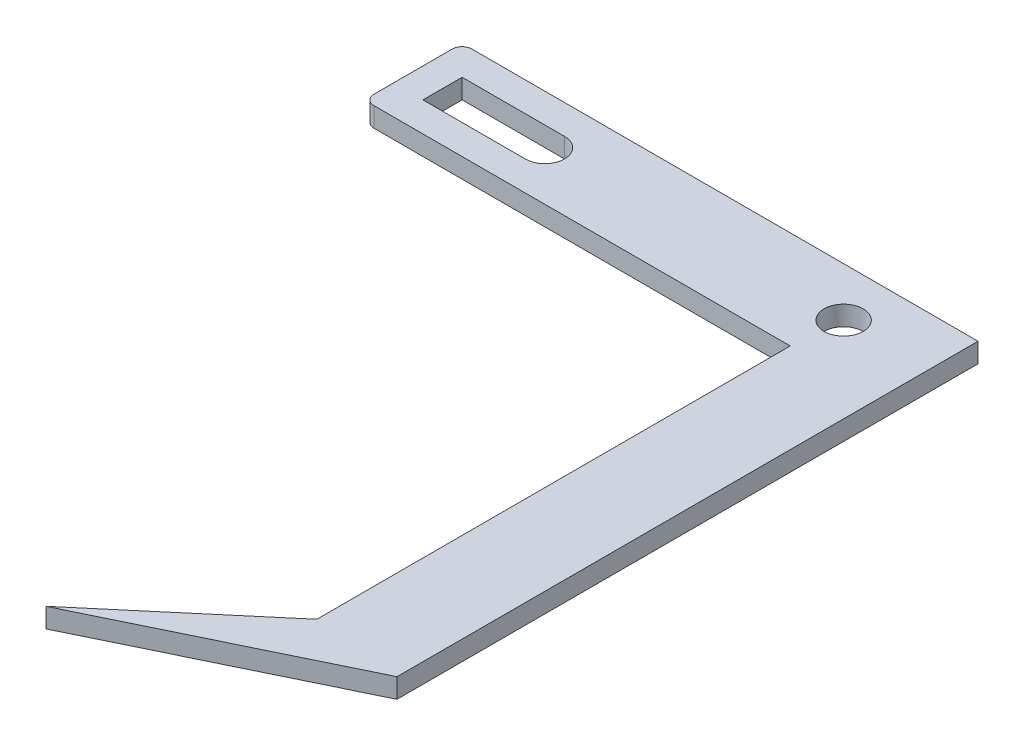
ISO-10303-21;
HEADER;
FILE_DESCRIPTION(('STEP AP214'),'2;1');
FILE_NAME('part.step','',(''),(''),'','','');
FILE_SCHEMA(('AUTOMOTIVE_DESIGN { 1 0 10303 214 1 1 1 1 }'));
ENDSEC;
DATA;
#1=APPLICATION_CONTEXT('core data for automotive mechanical design processes');
#2=APPLICATION_PROTOCOL_DEFINITION('international standard','automotive_design',2000,#1);
#3=PRODUCT_CONTEXT('',#1,'mechanical');
#4=PRODUCT('Part','Part','',(#3));
#5=PRODUCT_RELATED_PRODUCT_CATEGORY('part','',(#4));
#6=PRODUCT_DEFINITION_FORMATION('','',#4);
#7=PRODUCT_DEFINITION_CONTEXT('part definition',#1,'design');
#8=PRODUCT_DEFINITION('design','',#6,#7);
#9=PRODUCT_DEFINITION_SHAPE('','',#8);
#10=(LENGTH_UNIT() NAMED_UNIT(*) SI_UNIT(.MILLI.,.METRE.));
#11=(NAMED_UNIT(*) PLANE_ANGLE_UNIT() SI_UNIT($,.RADIAN.));
#12=(NAMED_UNIT(*) SI_UNIT($,.STERADIAN.) SOLID_ANGLE_UNIT());
#13=UNCERTAINTY_MEASURE_WITH_UNIT(LENGTH_MEASURE(1.E-05),#10,'distance_accuracy_value','');
#14=(GEOMETRIC_REPRESENTATION_CONTEXT(3) GLOBAL_UNCERTAINTY_ASSIGNED_CONTEXT((#13)) GLOBAL_UNIT_ASSIGNED_CONTEXT((#10,
#11,#12)) REPRESENTATION_CONTEXT('',''));
#15=CARTESIAN_POINT('',(0.,0.,0.));
#16=DIRECTION('',(0.,0.,1.));
#17=DIRECTION('',(1.,0.,0.));
#18=AXIS2_PLACEMENT_3D('',#15,#16,#17);
#19=CARTESIAN_POINT('',(1.,2.,-48.412862341502));
#20=DIRECTION('',(0.,1.,0.));
#21=DIRECTION('',(0.,0.,1.));
#22=AXIS2_PLACEMENT_3D('',#19,#20,#21);
#23=PLANE('',#22);
#24=CARTESIAN_POINT('',(45.48,2.,-41.7006090805018));
#25=DIRECTION('',(0.,1.,0.));
#26=DIRECTION('',(0.,0.,1.));
#27=AXIS2_PLACEMENT_3D('',#24,#25,#26);
#28=CIRCLE('',#27,2.);
#29=CARTESIAN_POINT('',(45.48,2.,-39.7006090805018));
#30=VERTEX_POINT('',#29);
#31=EDGE_CURVE('E196',#30,#30,#28,.T.);
#32=ORIENTED_EDGE('',*,*,#31,.F.);
#33=EDGE_LOOP('',(#32));
#34=FACE_BOUND('',#33,.T.);
#35=DIRECTION('',(-1.,0.,0.));
#36=VECTOR('',#35,1.);
#37=CARTESIAN_POINT('',(15.,2.,-43.7006090805018));
#38=LINE('',#37,#36);
#39=CARTESIAN_POINT('',(15.,2.,-43.7006090805018));
#40=VERTEX_POINT('',#39);
#41=CARTESIAN_POINT('',(4.54951644761081,2.,-43.7006090805018));
#42=VERTEX_POINT('',#41);
#43=EDGE_CURVE('E167',#40,#42,#38,.T.);
#44=ORIENTED_EDGE('',*,*,#43,.F.);
#45=CARTESIAN_POINT('',(15.,2.,-41.7006090805018));
#46=DIRECTION('',(0.,1.,0.));
#47=DIRECTION('',(0.,0.,1.));
#48=AXIS2_PLACEMENT_3D('',#45,#46,#47);
#49=CIRCLE('',#48,2.);
#50=CARTESIAN_POINT('',(15.,2.,-39.7006090805018));
#51=VERTEX_POINT('',#50);
#52=EDGE_CURVE('E165',#51,#40,#49,.T.);
#53=ORIENTED_EDGE('',*,*,#52,.F.);
#54=DIRECTION('',(1.,0.,0.));
#55=VECTOR('',#54,1.);
#56=CARTESIAN_POINT('',(4.54951644761081,2.,-39.7006090805018));
#57=LINE('',#56,#55);
#58=CARTESIAN_POINT('',(4.54951644761081,2.,-39.7006090805018));
#59=VERTEX_POINT('',#58);
#60=EDGE_CURVE('E173',#59,#51,#57,.T.);
#61=ORIENTED_EDGE('',*,*,#60,.F.);
#62=DIRECTION('',(0.,0.,1.));
#63=VECTOR('',#62,1.);
#64=CARTESIAN_POINT('',(4.54951644761081,2.,-43.7006090805018));
#65=LINE('',#64,#63);
#66=EDGE_CURVE('E170',#42,#59,#65,.T.);
#67=ORIENTED_EDGE('',*,*,#66,.F.);
#68=EDGE_LOOP('',(#44,#53,#61,#67));
#69=FACE_BOUND('',#68,.T.);
#70=DIRECTION('',(-1.,0.,0.));
#71=VECTOR('',#70,1.);
#72=CARTESIAN_POINT('',(0.,2.,-46.6920301733855));
#73=LINE('',#72,#71);
#74=CARTESIAN_POINT('',(54.2008321681165,2.,-46.6920301733855));
#75=VERTEX_POINT('',#74);
#76=CARTESIAN_POINT('',(2.54951644761081,2.,-46.6920301733855));
#77=VERTEX_POINT('',#76);
#78=EDGE_CURVE('E137',#75,#77,#73,.T.);
#79=ORIENTED_EDGE('',*,*,#78,.T.);
#80=CARTESIAN_POINT('',(2.54951644761081,2.,-45.6920301733855));
#81=DIRECTION('',(0.,1.,0.));
#82=DIRECTION('',(0.,0.,1.));
#83=AXIS2_PLACEMENT_3D('',#80,#81,#82);
#84=CIRCLE('',#83,1.);
#85=CARTESIAN_POINT('',(1.54951644761081,2.,-45.6920301733855));
#86=VERTEX_POINT('',#85);
#87=EDGE_CURVE('E125',#77,#86,#84,.T.);
#88=ORIENTED_EDGE('',*,*,#87,.T.);
#89=DIRECTION('',(0.,0.,-1.));
#90=VECTOR('',#89,1.);
#91=CARTESIAN_POINT('',(1.54951644761081,2.,0.));
#92=LINE('',#91,#90);
#93=CARTESIAN_POINT('',(1.54951644761081,2.,-37.6920301733855));
#94=VERTEX_POINT('',#93);
#95=EDGE_CURVE('E150',#94,#86,#92,.T.);
#96=ORIENTED_EDGE('',*,*,#95,.F.);
#97=CARTESIAN_POINT('',(2.54951644761081,2.,-37.6920301733855));
#98=DIRECTION('',(0.,1.,0.));
#99=DIRECTION('',(0.,0.,1.));
#100=AXIS2_PLACEMENT_3D('',#97,#98,#99);
#101=CIRCLE('',#100,1.);
#102=CARTESIAN_POINT('',(2.54951644761081,2.,-36.6920301733855));
#103=VERTEX_POINT('',#102);
#104=EDGE_CURVE('E55',#94,#103,#101,.T.);
#105=ORIENTED_EDGE('',*,*,#104,.T.);
#106=DIRECTION('',(1.,0.,0.));
#107=VECTOR('',#106,1.);
#108=CARTESIAN_POINT('',(1.,2.,-36.6920301733855));
#109=LINE('',#108,#107);
#110=CARTESIAN_POINT('',(45.0365276310284,2.,-36.6920301733855));
#111=VERTEX_POINT('',#110);
#112=EDGE_CURVE('E208',#103,#111,#109,.T.);
#113=ORIENTED_EDGE('',*,*,#112,.T.);
#114=DIRECTION('',(0.,0.,-1.));
#115=VECTOR('',#114,1.);
#116=CARTESIAN_POINT('',(45.0365276310284,2.,-36.6920301733855));
#117=LINE('',#116,#115);
#118=CARTESIAN_POINT('',(45.0365276310284,2.,11.6141165994602));
#119=VERTEX_POINT('',#118);
#120=EDGE_CURVE('E155',#119,#111,#117,.T.);
#121=ORIENTED_EDGE('',*,*,#120,.F.);
#122=DIRECTION('',(-0.763095427239992,0.,0.646285826028557));
#123=VECTOR('',#122,1.);
#124=CARTESIAN_POINT('',(38.3102977408543,2.,17.3107397024866));
#125=LINE('',#124,#123);
#126=CARTESIAN_POINT('',(30.071702425445,2.,24.2882253335987));
#127=VERTEX_POINT('',#126);
#128=EDGE_CURVE('E202',#119,#127,#125,.T.);
#129=ORIENTED_EDGE('',*,*,#128,.T.);
#130=DIRECTION('',(0.900013688421869,0.,-0.435861630168637));
#131=VECTOR('',#130,1.);
#132=CARTESIAN_POINT('',(30.071702425445,2.,24.2882253335987));
#133=LINE('',#132,#131);
#134=CARTESIAN_POINT('',(54.2008321681165,2.,12.6028899220536));
#135=VERTEX_POINT('',#134);
#136=EDGE_CURVE('E204',#127,#135,#133,.T.);
#137=ORIENTED_EDGE('',*,*,#136,.T.);
#138=DIRECTION('',(0.,0.,-1.));
#139=VECTOR('',#138,1.);
#140=CARTESIAN_POINT('',(54.2008321681165,2.,12.6028899220536));
#141=LINE('',#140,#139);
#142=EDGE_CURVE('E144',#135,#75,#141,.T.);
#143=ORIENTED_EDGE('',*,*,#142,.T.);
#144=EDGE_LOOP('',(#79,#88,#96,#105,#113,#121,#129,#137,#143));
#145=FACE_BOUND('',#144,.T.);
#146=ADVANCED_FACE('F33',(#34,#69,#145),#23,.T.);
#147=CARTESIAN_POINT('',(1.,0.,-48.412862341502));
#148=DIRECTION('',(0.,1.,0.));
#149=DIRECTION('',(0.,0.,1.));
#150=AXIS2_PLACEMENT_3D('',#147,#148,#149);
#151=PLANE('',#150);
#152=CARTESIAN_POINT('',(45.48,0.,-41.7006090805018));
#153=DIRECTION('',(0.,1.,0.));
#154=DIRECTION('',(0.,0.,1.));
#155=AXIS2_PLACEMENT_3D('',#152,#153,#154);
#156=CIRCLE('',#155,2.);
#157=CARTESIAN_POINT('',(45.48,0.,-39.7006090805018));
#158=VERTEX_POINT('',#157);
#159=EDGE_CURVE('E195',#158,#158,#156,.T.);
#160=ORIENTED_EDGE('',*,*,#159,.T.);
#161=EDGE_LOOP('',(#160));
#162=FACE_BOUND('',#161,.T.);
#163=CARTESIAN_POINT('',(15.,0.,-41.7006090805018));
#164=DIRECTION('',(0.,1.,0.));
#165=DIRECTION('',(0.,0.,1.));
#166=AXIS2_PLACEMENT_3D('',#163,#164,#165);
#167=CIRCLE('',#166,2.);
#168=CARTESIAN_POINT('',(15.,0.,-39.7006090805018));
#169=VERTEX_POINT('',#168);
#170=CARTESIAN_POINT('',(15.,0.,-43.7006090805018));
#171=VERTEX_POINT('',#170);
#172=EDGE_CURVE('E162',#169,#171,#167,.T.);
#173=ORIENTED_EDGE('',*,*,#172,.T.);
#174=DIRECTION('',(-1.,0.,0.));
#175=VECTOR('',#174,1.);
#176=CARTESIAN_POINT('',(15.,0.,-43.7006090805018));
#177=LINE('',#176,#175);
#178=CARTESIAN_POINT('',(4.54951644761081,0.,-43.7006090805018));
#179=VERTEX_POINT('',#178);
#180=EDGE_CURVE('E178',#171,#179,#177,.T.);
#181=ORIENTED_EDGE('',*,*,#180,.T.);
#182=DIRECTION('',(0.,0.,1.));
#183=VECTOR('',#182,1.);
#184=CARTESIAN_POINT('',(4.54951644761081,0.,-43.7006090805018));
#185=LINE('',#184,#183);
#186=CARTESIAN_POINT('',(4.54951644761081,0.,-39.7006090805018));
#187=VERTEX_POINT('',#186);
#188=EDGE_CURVE('E181',#179,#187,#185,.T.);
#189=ORIENTED_EDGE('',*,*,#188,.T.);
#190=DIRECTION('',(1.,0.,0.));
#191=VECTOR('',#190,1.);
#192=CARTESIAN_POINT('',(4.54951644761081,0.,-39.7006090805018));
#193=LINE('',#192,#191);
#194=EDGE_CURVE('E168',#187,#169,#193,.T.);
#195=ORIENTED_EDGE('',*,*,#194,.T.);
#196=EDGE_LOOP('',(#173,#181,#189,#195));
#197=FACE_BOUND('',#196,.T.);
#198=CARTESIAN_POINT('',(2.54951644761081,0.,-45.6920301733855));
#199=DIRECTION('',(0.,1.,0.));
#200=DIRECTION('',(0.,0.,1.));
#201=AXIS2_PLACEMENT_3D('',#198,#199,#200);
#202=CIRCLE('',#201,1.);
#203=CARTESIAN_POINT('',(2.54951644761081,0.,-46.6920301733855));
#204=VERTEX_POINT('',#203);
#205=CARTESIAN_POINT('',(1.54951644761081,0.,-45.6920301733855));
#206=VERTEX_POINT('',#205);
#207=EDGE_CURVE('E47',#204,#206,#202,.T.);
#208=ORIENTED_EDGE('',*,*,#207,.F.);
#209=DIRECTION('',(-1.,0.,0.));
#210=VECTOR('',#209,1.);
#211=CARTESIAN_POINT('',(1.,0.,-46.6920301733855));
#212=LINE('',#211,#210);
#213=CARTESIAN_POINT('',(54.2008321681165,0.,-46.6920301733855));
#214=VERTEX_POINT('',#213);
#215=EDGE_CURVE('E140',#214,#204,#212,.T.);
#216=ORIENTED_EDGE('',*,*,#215,.F.);
#217=DIRECTION('',(0.,0.,-1.));
#218=VECTOR('',#217,1.);
#219=CARTESIAN_POINT('',(54.2008321681165,0.,-49.412862341502));
#220=LINE('',#219,#218);
#221=CARTESIAN_POINT('',(54.2008321681165,0.,12.6028899220536));
#222=VERTEX_POINT('',#221);
#223=EDGE_CURVE('E215',#222,#214,#220,.T.);
#224=ORIENTED_EDGE('',*,*,#223,.F.);
#225=DIRECTION('',(0.900013688421869,0.,-0.435861630168637));
#226=VECTOR('',#225,1.);
#227=CARTESIAN_POINT('',(30.071702425445,0.,24.2882253335987));
#228=LINE('',#227,#226);
#229=CARTESIAN_POINT('',(30.071702425445,0.,24.2882253335987));
#230=VERTEX_POINT('',#229);
#231=EDGE_CURVE('E212',#230,#222,#228,.T.);
#232=ORIENTED_EDGE('',*,*,#231,.F.);
#233=DIRECTION('',(-0.763095427239992,0.,0.646285826028557));
#234=VECTOR('',#233,1.);
#235=CARTESIAN_POINT('',(30.071702425445,0.,24.2882253335987));
#236=LINE('',#235,#234);
#237=CARTESIAN_POINT('',(45.0365276310284,0.,11.6141165994602));
#238=VERTEX_POINT('',#237);
#239=EDGE_CURVE('E199',#238,#230,#236,.T.);
#240=ORIENTED_EDGE('',*,*,#239,.F.);
#241=DIRECTION('',(0.,0.,-1.));
#242=VECTOR('',#241,1.);
#243=CARTESIAN_POINT('',(45.0365276310284,0.,-48.412862341502));
#244=LINE('',#243,#242);
#245=CARTESIAN_POINT('',(45.0365276310284,0.,-36.6920301733855));
#246=VERTEX_POINT('',#245);
#247=EDGE_CURVE('E224',#238,#246,#244,.T.);
#248=ORIENTED_EDGE('',*,*,#247,.T.);
#249=DIRECTION('',(1.,0.,0.));
#250=VECTOR('',#249,1.);
#251=CARTESIAN_POINT('',(31.48,0.,-36.6920301733855));
#252=LINE('',#251,#250);
#253=CARTESIAN_POINT('',(2.54951644761081,0.,-36.6920301733855));
#254=VERTEX_POINT('',#253);
#255=EDGE_CURVE('E205',#254,#246,#252,.T.);
#256=ORIENTED_EDGE('',*,*,#255,.F.);
#257=CARTESIAN_POINT('',(2.54951644761081,0.,-37.6920301733855));
#258=DIRECTION('',(0.,1.,0.));
#259=DIRECTION('',(0.,0.,1.));
#260=AXIS2_PLACEMENT_3D('',#257,#258,#259);
#261=CIRCLE('',#260,1.);
#262=CARTESIAN_POINT('',(1.54951644761081,0.,-37.6920301733855));
#263=VERTEX_POINT('',#262);
#264=EDGE_CURVE('E231',#263,#254,#261,.T.);
#265=ORIENTED_EDGE('',*,*,#264,.F.);
#266=DIRECTION('',(0.,0.,-1.));
#267=VECTOR('',#266,1.);
#268=CARTESIAN_POINT('',(1.54951644761081,0.,-48.412862341502));
#269=LINE('',#268,#267);
#270=EDGE_CURVE('E146',#263,#206,#269,.T.);
#271=ORIENTED_EDGE('',*,*,#270,.T.);
#272=EDGE_LOOP('',(#208,#216,#224,#232,#240,#248,#256,#265,#271));
#273=FACE_BOUND('',#272,.T.);
#274=ADVANCED_FACE('F244',(#162,#197,#273),#151,.F.);
#275=CARTESIAN_POINT('',(0.,-8.,-46.6920301733855));
#276=DIRECTION('',(0.,0.,-1.));
#277=DIRECTION('',(-1.,0.,0.));
#278=AXIS2_PLACEMENT_3D('',#275,#276,#277);
#279=PLANE('',#278);
#280=ORIENTED_EDGE('',*,*,#215,.T.);
#281=DIRECTION('',(0.,1.,0.));
#282=VECTOR('',#281,1.);
#283=CARTESIAN_POINT('',(2.54951644761081,-18.,-46.6920301733855));
#284=LINE('',#283,#282);
#285=EDGE_CURVE('E128',#204,#77,#284,.T.);
#286=ORIENTED_EDGE('',*,*,#285,.T.);
#287=ORIENTED_EDGE('',*,*,#78,.F.);
#288=DIRECTION('',(0.,1.,0.));
#289=VECTOR('',#288,1.);
#290=CARTESIAN_POINT('',(54.2008321681165,-8.,-46.6920301733855));
#291=LINE('',#290,#289);
#292=EDGE_CURVE('E145',#214,#75,#291,.T.);
#293=ORIENTED_EDGE('',*,*,#292,.F.);
#294=EDGE_LOOP('',(#280,#286,#287,#293));
#295=FACE_BOUND('',#294,.T.);
#296=ADVANCED_FACE('F136',(#295),#279,.T.);
#297=CARTESIAN_POINT('',(1.54951644761081,-8.,0.));
#298=DIRECTION('',(1.,0.,0.));
#299=DIRECTION('',(0.,0.,-1.));
#300=AXIS2_PLACEMENT_3D('',#297,#298,#299);
#301=PLANE('',#300);
#302=DIRECTION('',(0.,1.,0.));
#303=VECTOR('',#302,1.);
#304=CARTESIAN_POINT('',(1.54951644761081,-18.,-45.6920301733855));
#305=LINE('',#304,#303);
#306=EDGE_CURVE('E11',#206,#86,#305,.T.);
#307=ORIENTED_EDGE('',*,*,#306,.F.);
#308=ORIENTED_EDGE('',*,*,#270,.F.);
#309=DIRECTION('',(0.,1.,0.));
#310=VECTOR('',#309,1.);
#311=CARTESIAN_POINT('',(1.54951644761081,-18.,-37.6920301733855));
#312=LINE('',#311,#310);
#313=EDGE_CURVE('E41',#263,#94,#312,.T.);
#314=ORIENTED_EDGE('',*,*,#313,.T.);
#315=ORIENTED_EDGE('',*,*,#95,.T.);
#316=EDGE_LOOP('',(#307,#308,#314,#315));
#317=FACE_BOUND('',#316,.T.);
#318=ADVANCED_FACE('F228',(#317),#301,.F.);
#319=CARTESIAN_POINT('',(31.48,2.,-36.6920301733855));
#320=DIRECTION('',(0.,0.,-1.));
#321=DIRECTION('',(-1.,0.,0.));
#322=AXIS2_PLACEMENT_3D('',#319,#320,#321);
#323=PLANE('',#322);
#324=DIRECTION('',(0.,1.,0.));
#325=VECTOR('',#324,1.);
#326=CARTESIAN_POINT('',(2.54951644761081,-18.,-36.6920301733855));
#327=LINE('',#326,#325);
#328=EDGE_CURVE('E232',#254,#103,#327,.T.);
#329=ORIENTED_EDGE('',*,*,#328,.F.);
#330=ORIENTED_EDGE('',*,*,#255,.T.);
#331=DIRECTION('',(0.,1.,0.));
#332=VECTOR('',#331,1.);
#333=CARTESIAN_POINT('',(45.0365276310284,-7.,-36.6920301733855));
#334=LINE('',#333,#332);
#335=EDGE_CURVE('E159',#246,#111,#334,.T.);
#336=ORIENTED_EDGE('',*,*,#335,.T.);
#337=ORIENTED_EDGE('',*,*,#112,.F.);
#338=EDGE_LOOP('',(#329,#330,#336,#337));
#339=FACE_BOUND('',#338,.T.);
#340=ADVANCED_FACE('F241',(#339),#323,.F.);
#341=CARTESIAN_POINT('',(54.2008321681165,2.,-49.412862341502));
#342=DIRECTION('',(-1.,0.,0.));
#343=DIRECTION('',(0.,0.,1.));
#344=AXIS2_PLACEMENT_3D('',#341,#342,#343);
#345=PLANE('',#344);
#346=ORIENTED_EDGE('',*,*,#292,.T.);
#347=ORIENTED_EDGE('',*,*,#142,.F.);
#348=DIRECTION('',(0.,-1.,0.));
#349=VECTOR('',#348,1.);
#350=CARTESIAN_POINT('',(54.2008321681165,2.,12.6028899220536));
#351=LINE('',#350,#349);
#352=EDGE_CURVE('E210',#135,#222,#351,.T.);
#353=ORIENTED_EDGE('',*,*,#352,.T.);
#354=ORIENTED_EDGE('',*,*,#223,.T.);
#355=EDGE_LOOP('',(#346,#347,#353,#354));
#356=FACE_BOUND('',#355,.T.);
#357=ADVANCED_FACE('F258',(#356),#345,.F.);
#358=CARTESIAN_POINT('',(30.071702425445,2.,24.2882253335987));
#359=DIRECTION('',(0.646285826028557,0.,0.763095427239992));
#360=DIRECTION('',(0.763095427239992,0.,-0.646285826028557));
#361=AXIS2_PLACEMENT_3D('',#358,#359,#360);
#362=PLANE('',#361);
#363=ORIENTED_EDGE('',*,*,#239,.T.);
#364=DIRECTION('',(0.,-1.,0.));
#365=VECTOR('',#364,1.);
#366=CARTESIAN_POINT('',(30.071702425445,2.,24.2882253335987));
#367=LINE('',#366,#365);
#368=EDGE_CURVE('E221',#127,#230,#367,.T.);
#369=ORIENTED_EDGE('',*,*,#368,.F.);
#370=ORIENTED_EDGE('',*,*,#128,.F.);
#371=DIRECTION('',(0.,1.,0.));
#372=VECTOR('',#371,1.);
#373=CARTESIAN_POINT('',(45.0365276310284,-7.,11.6141165994602));
#374=LINE('',#373,#372);
#375=EDGE_CURVE('E158',#238,#119,#374,.T.);
#376=ORIENTED_EDGE('',*,*,#375,.F.);
#377=EDGE_LOOP('',(#363,#369,#370,#376));
#378=FACE_BOUND('',#377,.T.);
#379=ADVANCED_FACE('F35',(#378),#362,.F.);
#380=CARTESIAN_POINT('',(30.071702425445,2.,24.2882253335987));
#381=DIRECTION('',(-0.435861630168637,0.,-0.90001368842187));
#382=DIRECTION('',(-0.90001368842187,0.,0.435861630168637));
#383=AXIS2_PLACEMENT_3D('',#380,#381,#382);
#384=PLANE('',#383);
#385=ORIENTED_EDGE('',*,*,#231,.T.);
#386=ORIENTED_EDGE('',*,*,#352,.F.);
#387=ORIENTED_EDGE('',*,*,#136,.F.);
#388=ORIENTED_EDGE('',*,*,#368,.T.);
#389=EDGE_LOOP('',(#385,#386,#387,#388));
#390=FACE_BOUND('',#389,.T.);
#391=ADVANCED_FACE('F256',(#390),#384,.F.);
#392=CARTESIAN_POINT('',(45.48,2.,-41.7006090805018));
#393=DIRECTION('',(0.,-1.,0.));
#394=DIRECTION('',(0.,0.,-1.));
#395=AXIS2_PLACEMENT_3D('',#392,#393,#394);
#396=CYLINDRICAL_SURFACE('',#395,2.);
#397=ORIENTED_EDGE('',*,*,#31,.T.);
#398=EDGE_LOOP('',(#397));
#399=FACE_BOUND('',#398,.T.);
#400=ORIENTED_EDGE('',*,*,#159,.F.);
#401=EDGE_LOOP('',(#400));
#402=FACE_BOUND('',#401,.T.);
#403=ADVANCED_FACE('F278',(#399,#402),#396,.F.);
#404=CARTESIAN_POINT('',(15.,2.,-41.7006090805018));
#405=DIRECTION('',(0.,-1.,0.));
#406=DIRECTION('',(0.,0.,-1.));
#407=AXIS2_PLACEMENT_3D('',#404,#405,#406);
#408=CYLINDRICAL_SURFACE('',#407,2.);
#409=ORIENTED_EDGE('',*,*,#172,.F.);
#410=DIRECTION('',(0.,-1.,0.));
#411=VECTOR('',#410,1.);
#412=CARTESIAN_POINT('',(15.,2.,-39.7006090805018));
#413=LINE('',#412,#411);
#414=EDGE_CURVE('E175',#51,#169,#413,.T.);
#415=ORIENTED_EDGE('',*,*,#414,.F.);
#416=ORIENTED_EDGE('',*,*,#52,.T.);
#417=DIRECTION('',(0.,-1.,0.));
#418=VECTOR('',#417,1.);
#419=CARTESIAN_POINT('',(15.,2.,-43.7006090805018));
#420=LINE('',#419,#418);
#421=EDGE_CURVE('E192',#40,#171,#420,.T.);
#422=ORIENTED_EDGE('',*,*,#421,.T.);
#423=EDGE_LOOP('',(#409,#415,#416,#422));
#424=FACE_BOUND('',#423,.T.);
#425=ADVANCED_FACE('F281',(#424),#408,.F.);
#426=CARTESIAN_POINT('',(15.,2.,-43.7006090805018));
#427=DIRECTION('',(0.,0.,1.));
#428=DIRECTION('',(1.,0.,0.));
#429=AXIS2_PLACEMENT_3D('',#426,#427,#428);
#430=PLANE('',#429);
#431=ORIENTED_EDGE('',*,*,#180,.F.);
#432=ORIENTED_EDGE('',*,*,#421,.F.);
#433=ORIENTED_EDGE('',*,*,#43,.T.);
#434=DIRECTION('',(0.,-1.,0.));
#435=VECTOR('',#434,1.);
#436=CARTESIAN_POINT('',(4.54951644761081,2.,-43.7006090805018));
#437=LINE('',#436,#435);
#438=EDGE_CURVE('E190',#42,#179,#437,.T.);
#439=ORIENTED_EDGE('',*,*,#438,.T.);
#440=EDGE_LOOP('',(#431,#432,#433,#439));
#441=FACE_BOUND('',#440,.T.);
#442=ADVANCED_FACE('F285',(#441),#430,.T.);
#443=CARTESIAN_POINT('',(4.54951644761081,2.,-43.7006090805018));
#444=DIRECTION('',(1.,0.,0.));
#445=DIRECTION('',(0.,0.,-1.));
#446=AXIS2_PLACEMENT_3D('',#443,#444,#445);
#447=PLANE('',#446);
#448=ORIENTED_EDGE('',*,*,#188,.F.);
#449=ORIENTED_EDGE('',*,*,#438,.F.);
#450=ORIENTED_EDGE('',*,*,#66,.T.);
#451=DIRECTION('',(0.,-1.,0.));
#452=VECTOR('',#451,1.);
#453=CARTESIAN_POINT('',(4.54951644761081,2.,-39.7006090805018));
#454=LINE('',#453,#452);
#455=EDGE_CURVE('E188',#59,#187,#454,.T.);
#456=ORIENTED_EDGE('',*,*,#455,.T.);
#457=EDGE_LOOP('',(#448,#449,#450,#456));
#458=FACE_BOUND('',#457,.T.);
#459=ADVANCED_FACE('F289',(#458),#447,.T.);
#460=CARTESIAN_POINT('',(4.54951644761081,2.,-39.7006090805018));
#461=DIRECTION('',(0.,0.,-1.));
#462=DIRECTION('',(-1.,0.,0.));
#463=AXIS2_PLACEMENT_3D('',#460,#461,#462);
#464=PLANE('',#463);
#465=ORIENTED_EDGE('',*,*,#194,.F.);
#466=ORIENTED_EDGE('',*,*,#455,.F.);
#467=ORIENTED_EDGE('',*,*,#60,.T.);
#468=ORIENTED_EDGE('',*,*,#414,.T.);
#469=EDGE_LOOP('',(#465,#466,#467,#468));
#470=FACE_BOUND('',#469,.T.);
#471=ADVANCED_FACE('F293',(#470),#464,.T.);
#472=CARTESIAN_POINT('',(45.0365276310284,-7.,-36.6920301733855));
#473=DIRECTION('',(1.,0.,0.));
#474=DIRECTION('',(0.,0.,-1.));
#475=AXIS2_PLACEMENT_3D('',#472,#473,#474);
#476=PLANE('',#475);
#477=ORIENTED_EDGE('',*,*,#375,.T.);
#478=ORIENTED_EDGE('',*,*,#120,.T.);
#479=ORIENTED_EDGE('',*,*,#335,.F.);
#480=ORIENTED_EDGE('',*,*,#247,.F.);
#481=EDGE_LOOP('',(#477,#478,#479,#480));
#482=FACE_BOUND('',#481,.T.);
#483=ADVANCED_FACE('F249',(#482),#476,.F.);
#484=CARTESIAN_POINT('',(2.54951644761081,-18.,-37.6920301733855));
#485=DIRECTION('',(0.,1.,0.));
#486=DIRECTION('',(0.,0.,1.));
#487=AXIS2_PLACEMENT_3D('',#484,#485,#486);
#488=CYLINDRICAL_SURFACE('',#487,1.);
#489=ORIENTED_EDGE('',*,*,#264,.T.);
#490=ORIENTED_EDGE('',*,*,#328,.T.);
#491=ORIENTED_EDGE('',*,*,#104,.F.);
#492=ORIENTED_EDGE('',*,*,#313,.F.);
#493=EDGE_LOOP('',(#489,#490,#491,#492));
#494=FACE_BOUND('',#493,.T.);
#495=ADVANCED_FACE('F238',(#494),#488,.T.);
#496=CARTESIAN_POINT('',(2.54951644761081,-18.,-45.6920301733855));
#497=DIRECTION('',(0.,1.,0.));
#498=DIRECTION('',(0.,0.,1.));
#499=AXIS2_PLACEMENT_3D('',#496,#497,#498);
#500=CYLINDRICAL_SURFACE('',#499,1.);
#501=ORIENTED_EDGE('',*,*,#207,.T.);
#502=ORIENTED_EDGE('',*,*,#306,.T.);
#503=ORIENTED_EDGE('',*,*,#87,.F.);
#504=ORIENTED_EDGE('',*,*,#285,.F.);
#505=EDGE_LOOP('',(#501,#502,#503,#504));
#506=FACE_BOUND('',#505,.T.);
#507=ADVANCED_FACE('F127',(#506),#500,.T.);
#508=CLOSED_SHELL('',(#146,#274,#296,#318,#340,#357,#379,#391,#403,#425,#442,#459,#471,#483,
#495,#507));
#509=MANIFOLD_SOLID_BREP('B2',#508);
#510=ADVANCED_BREP_SHAPE_REPRESENTATION('',(#18,#509),#14);
#511=SHAPE_DEFINITION_REPRESENTATION(#9,#510);
ENDSEC;
END-ISO-10303-21;
